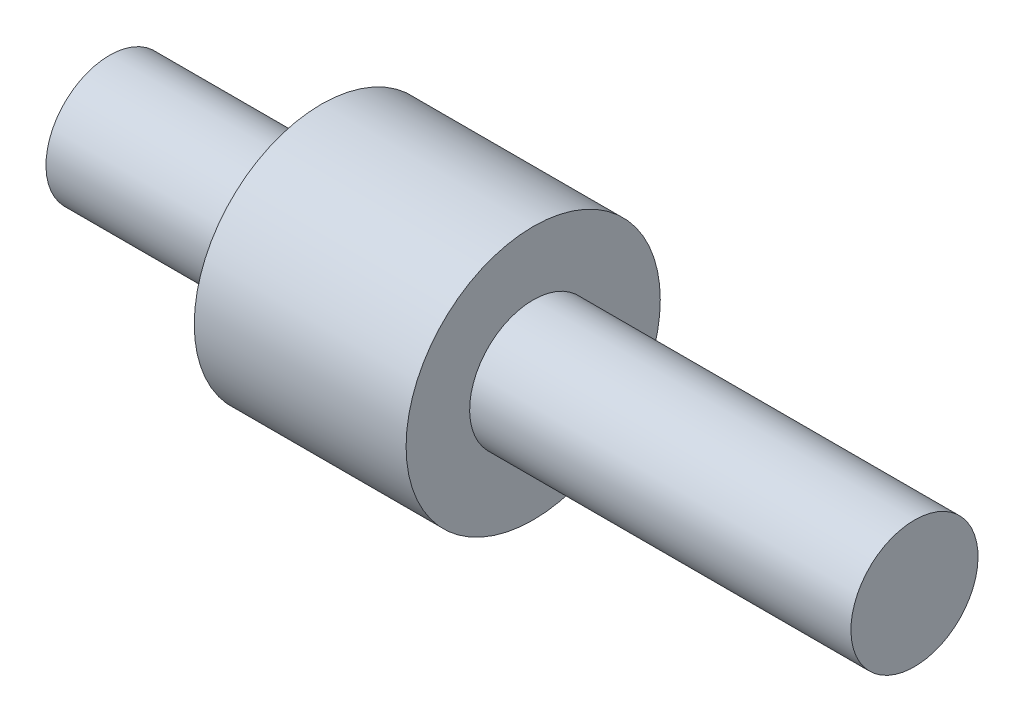
ISO-10303-21;
HEADER;
FILE_DESCRIPTION(('STEP AP214'),'2;1');
FILE_NAME('part.step','',(''),(''),'','','');
FILE_SCHEMA(('AUTOMOTIVE_DESIGN { 1 0 10303 214 1 1 1 1 }'));
ENDSEC;
DATA;
#1=APPLICATION_CONTEXT('core data for automotive mechanical design processes');
#2=APPLICATION_PROTOCOL_DEFINITION('international standard','automotive_design',2000,#1);
#3=PRODUCT_CONTEXT('',#1,'mechanical');
#4=PRODUCT('Part','Part','',(#3));
#5=PRODUCT_RELATED_PRODUCT_CATEGORY('part','',(#4));
#6=PRODUCT_DEFINITION_FORMATION('','',#4);
#7=PRODUCT_DEFINITION_CONTEXT('part definition',#1,'design');
#8=PRODUCT_DEFINITION('design','',#6,#7);
#9=PRODUCT_DEFINITION_SHAPE('','',#8);
#10=(LENGTH_UNIT() NAMED_UNIT(*) SI_UNIT(.MILLI.,.METRE.));
#11=(NAMED_UNIT(*) PLANE_ANGLE_UNIT() SI_UNIT($,.RADIAN.));
#12=(NAMED_UNIT(*) SI_UNIT($,.STERADIAN.) SOLID_ANGLE_UNIT());
#13=UNCERTAINTY_MEASURE_WITH_UNIT(LENGTH_MEASURE(1.E-05),#10,'distance_accuracy_value','');
#14=(GEOMETRIC_REPRESENTATION_CONTEXT(3) GLOBAL_UNCERTAINTY_ASSIGNED_CONTEXT((#13)) GLOBAL_UNIT_ASSIGNED_CONTEXT((#10,
#11,#12)) REPRESENTATION_CONTEXT('',''));
#15=CARTESIAN_POINT('',(0.,0.,0.));
#16=DIRECTION('',(0.,0.,1.));
#17=DIRECTION('',(1.,0.,0.));
#18=AXIS2_PLACEMENT_3D('',#15,#16,#17);
#19=CARTESIAN_POINT('',(0.,0.,0.));
#20=DIRECTION('',(-1.,0.,0.));
#21=DIRECTION('',(0.,-1.,0.));
#22=AXIS2_PLACEMENT_3D('',#19,#20,#21);
#23=PLANE('',#22);
#24=CARTESIAN_POINT('',(0.,0.,0.));
#25=DIRECTION('',(1.,0.,0.));
#26=DIRECTION('',(0.,1.,0.));
#27=AXIS2_PLACEMENT_3D('',#24,#25,#26);
#28=CIRCLE('',#27,1.5);
#29=CARTESIAN_POINT('',(0.,1.5,0.));
#30=VERTEX_POINT('',#29);
#31=EDGE_CURVE('E10',#30,#30,#28,.T.);
#32=ORIENTED_EDGE('',*,*,#31,.F.);
#33=EDGE_LOOP('',(#32));
#34=FACE_BOUND('',#33,.T.);
#35=ADVANCED_FACE('F31',(#34),#23,.T.);
#36=CARTESIAN_POINT('',(19.,0.,0.));
#37=DIRECTION('',(1.,0.,0.));
#38=DIRECTION('',(0.,1.,0.));
#39=AXIS2_PLACEMENT_3D('',#36,#37,#38);
#40=CYLINDRICAL_SURFACE('',#39,1.5);
#41=ORIENTED_EDGE('',*,*,#31,.T.);
#42=EDGE_LOOP('',(#41));
#43=FACE_BOUND('',#42,.T.);
#44=CARTESIAN_POINT('',(5.,0.,0.));
#45=DIRECTION('',(1.,0.,0.));
#46=DIRECTION('',(0.,1.,0.));
#47=AXIS2_PLACEMENT_3D('',#44,#45,#46);
#48=CIRCLE('',#47,1.5);
#49=CARTESIAN_POINT('',(5.,1.5,0.));
#50=VERTEX_POINT('',#49);
#51=EDGE_CURVE('E37',#50,#50,#48,.T.);
#52=ORIENTED_EDGE('',*,*,#51,.F.);
#53=EDGE_LOOP('',(#52));
#54=FACE_BOUND('',#53,.T.);
#55=ADVANCED_FACE('F73',(#43,#54),#40,.T.);
#56=CARTESIAN_POINT('',(5.,1.5,0.));
#57=DIRECTION('',(-1.,0.,0.));
#58=DIRECTION('',(0.,-1.,0.));
#59=AXIS2_PLACEMENT_3D('',#56,#57,#58);
#60=PLANE('',#59);
#61=ORIENTED_EDGE('',*,*,#51,.T.);
#62=EDGE_LOOP('',(#61));
#63=FACE_BOUND('',#62,.T.);
#64=CARTESIAN_POINT('',(5.,0.,0.));
#65=DIRECTION('',(1.,0.,0.));
#66=DIRECTION('',(0.,1.,0.));
#67=AXIS2_PLACEMENT_3D('',#64,#65,#66);
#68=CIRCLE('',#67,3.);
#69=CARTESIAN_POINT('',(5.,3.,0.));
#70=VERTEX_POINT('',#69);
#71=EDGE_CURVE('E41',#70,#70,#68,.T.);
#72=ORIENTED_EDGE('',*,*,#71,.F.);
#73=EDGE_LOOP('',(#72));
#74=FACE_BOUND('',#73,.T.);
#75=ADVANCED_FACE('F78',(#63,#74),#60,.T.);
#76=CARTESIAN_POINT('',(19.,0.,0.));
#77=DIRECTION('',(1.,0.,0.));
#78=DIRECTION('',(0.,1.,0.));
#79=AXIS2_PLACEMENT_3D('',#76,#77,#78);
#80=CYLINDRICAL_SURFACE('',#79,3.);
#81=ORIENTED_EDGE('',*,*,#71,.T.);
#82=EDGE_LOOP('',(#81));
#83=FACE_BOUND('',#82,.T.);
#84=CARTESIAN_POINT('',(10.,0.,0.));
#85=DIRECTION('',(1.,0.,0.));
#86=DIRECTION('',(0.,1.,0.));
#87=AXIS2_PLACEMENT_3D('',#84,#85,#86);
#88=CIRCLE('',#87,3.);
#89=CARTESIAN_POINT('',(10.,3.,0.));
#90=VERTEX_POINT('',#89);
#91=EDGE_CURVE('E45',#90,#90,#88,.T.);
#92=ORIENTED_EDGE('',*,*,#91,.F.);
#93=EDGE_LOOP('',(#92));
#94=FACE_BOUND('',#93,.T.);
#95=ADVANCED_FACE('F69',(#83,#94),#80,.T.);
#96=CARTESIAN_POINT('',(10.,3.,0.));
#97=DIRECTION('',(1.,0.,0.));
#98=DIRECTION('',(0.,1.,0.));
#99=AXIS2_PLACEMENT_3D('',#96,#97,#98);
#100=PLANE('',#99);
#101=ORIENTED_EDGE('',*,*,#91,.T.);
#102=EDGE_LOOP('',(#101));
#103=FACE_BOUND('',#102,.T.);
#104=CARTESIAN_POINT('',(10.,0.,0.));
#105=DIRECTION('',(1.,0.,0.));
#106=DIRECTION('',(0.,1.,0.));
#107=AXIS2_PLACEMENT_3D('',#104,#105,#106);
#108=CIRCLE('',#107,1.5);
#109=CARTESIAN_POINT('',(10.,1.5,0.));
#110=VERTEX_POINT('',#109);
#111=EDGE_CURVE('E50',#110,#110,#108,.T.);
#112=ORIENTED_EDGE('',*,*,#111,.F.);
#113=EDGE_LOOP('',(#112));
#114=FACE_BOUND('',#113,.T.);
#115=ADVANCED_FACE('F61',(#103,#114),#100,.T.);
#116=CARTESIAN_POINT('',(19.,0.,0.));
#117=DIRECTION('',(1.,0.,0.));
#118=DIRECTION('',(0.,1.,0.));
#119=AXIS2_PLACEMENT_3D('',#116,#117,#118);
#120=CYLINDRICAL_SURFACE('',#119,1.5);
#121=ORIENTED_EDGE('',*,*,#111,.T.);
#122=EDGE_LOOP('',(#121));
#123=FACE_BOUND('',#122,.T.);
#124=CARTESIAN_POINT('',(19.,0.,0.));
#125=DIRECTION('',(1.,0.,0.));
#126=DIRECTION('',(0.,1.,0.));
#127=AXIS2_PLACEMENT_3D('',#124,#125,#126);
#128=CIRCLE('',#127,1.5);
#129=CARTESIAN_POINT('',(19.,1.5,0.));
#130=VERTEX_POINT('',#129);
#131=EDGE_CURVE('E53',#130,#130,#128,.T.);
#132=ORIENTED_EDGE('',*,*,#131,.F.);
#133=EDGE_LOOP('',(#132));
#134=FACE_BOUND('',#133,.T.);
#135=ADVANCED_FACE('F59',(#123,#134),#120,.T.);
#136=CARTESIAN_POINT('',(19.,1.5,0.));
#137=DIRECTION('',(1.,0.,0.));
#138=DIRECTION('',(0.,1.,0.));
#139=AXIS2_PLACEMENT_3D('',#136,#137,#138);
#140=PLANE('',#139);
#141=ORIENTED_EDGE('',*,*,#131,.T.);
#142=EDGE_LOOP('',(#141));
#143=FACE_BOUND('',#142,.T.);
#144=ADVANCED_FACE('F57',(#143),#140,.T.);
#145=CLOSED_SHELL('',(#35,#55,#75,#95,#115,#135,#144));
#146=MANIFOLD_SOLID_BREP('B2',#145);
#147=ADVANCED_BREP_SHAPE_REPRESENTATION('',(#18,#146),#14);
#148=SHAPE_DEFINITION_REPRESENTATION(#9,#147);
ENDSEC;
END-ISO-10303-21;
